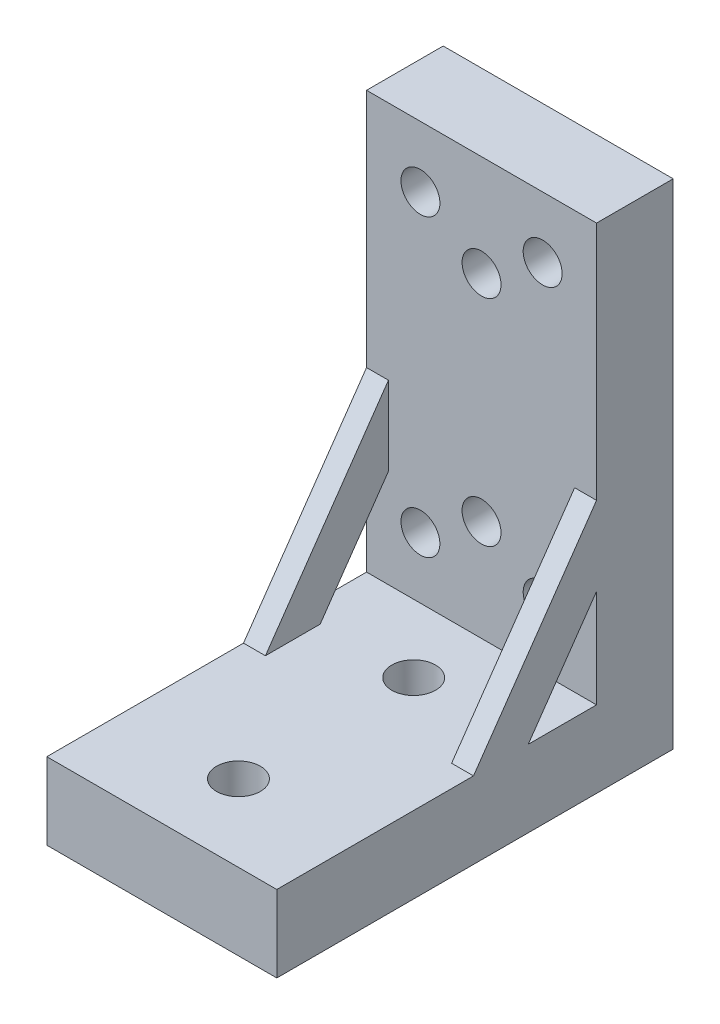
ISO-10303-21;
HEADER;
FILE_DESCRIPTION(('STEP AP214'),'2;1');
FILE_NAME('part.step','',(''),(''),'','','');
FILE_SCHEMA(('AUTOMOTIVE_DESIGN { 1 0 10303 214 1 1 1 1 }'));
ENDSEC;
DATA;
#1=APPLICATION_CONTEXT('core data for automotive mechanical design processes');
#2=APPLICATION_PROTOCOL_DEFINITION('international standard','automotive_design',2000,#1);
#3=PRODUCT_CONTEXT('',#1,'mechanical');
#4=PRODUCT('Part','Part','',(#3));
#5=PRODUCT_RELATED_PRODUCT_CATEGORY('part','',(#4));
#6=PRODUCT_DEFINITION_FORMATION('','',#4);
#7=PRODUCT_DEFINITION_CONTEXT('part definition',#1,'design');
#8=PRODUCT_DEFINITION('design','',#6,#7);
#9=PRODUCT_DEFINITION_SHAPE('','',#8);
#10=(LENGTH_UNIT() NAMED_UNIT(*) SI_UNIT(.MILLI.,.METRE.));
#11=(NAMED_UNIT(*) PLANE_ANGLE_UNIT() SI_UNIT($,.RADIAN.));
#12=(NAMED_UNIT(*) SI_UNIT($,.STERADIAN.) SOLID_ANGLE_UNIT());
#13=UNCERTAINTY_MEASURE_WITH_UNIT(LENGTH_MEASURE(1.E-05),#10,'distance_accuracy_value','');
#14=(GEOMETRIC_REPRESENTATION_CONTEXT(3) GLOBAL_UNCERTAINTY_ASSIGNED_CONTEXT((#13)) GLOBAL_UNIT_ASSIGNED_CONTEXT((#10,
#11,#12)) REPRESENTATION_CONTEXT('',''));
#15=CARTESIAN_POINT('',(0.,0.,0.));
#16=DIRECTION('',(0.,0.,1.));
#17=DIRECTION('',(1.,0.,0.));
#18=AXIS2_PLACEMENT_3D('',#15,#16,#17);
#19=CARTESIAN_POINT('',(0.,0.,7.));
#20=DIRECTION('',(0.,0.,1.));
#21=DIRECTION('',(1.,0.,0.));
#22=AXIS2_PLACEMENT_3D('',#19,#20,#21);
#23=PLANE('',#22);
#24=DIRECTION('',(-1.,0.,0.));
#25=VECTOR('',#24,1.);
#26=CARTESIAN_POINT('',(0.,-2.87885066998273,7.));
#27=LINE('',#26,#25);
#28=CARTESIAN_POINT('',(-8.49999999999999,-2.87885066998273,7.));
#29=VERTEX_POINT('',#28);
#30=CARTESIAN_POINT('',(-10.5,-2.87885066998273,7.));
#31=VERTEX_POINT('',#30);
#32=EDGE_CURVE('E179',#29,#31,#27,.T.);
#33=ORIENTED_EDGE('',*,*,#32,.F.);
#34=DIRECTION('',(0.,1.,0.));
#35=VECTOR('',#34,1.);
#36=CARTESIAN_POINT('',(-8.49999999999999,0.,7.));
#37=LINE('',#36,#35);
#38=CARTESIAN_POINT('',(-8.49999999999999,-10.0759773449372,7.));
#39=VERTEX_POINT('',#38);
#40=EDGE_CURVE('E55',#39,#29,#37,.T.);
#41=ORIENTED_EDGE('',*,*,#40,.F.);
#42=DIRECTION('',(1.,0.,0.));
#43=VECTOR('',#42,1.);
#44=CARTESIAN_POINT('',(0.,-10.0759773449371,7.));
#45=LINE('',#44,#43);
#46=CARTESIAN_POINT('',(-10.5,-10.0759773449371,7.));
#47=VERTEX_POINT('',#46);
#48=EDGE_CURVE('E59',#47,#39,#45,.T.);
#49=ORIENTED_EDGE('',*,*,#48,.F.);
#50=DIRECTION('',(0.,-1.,0.));
#51=VECTOR('',#50,1.);
#52=CARTESIAN_POINT('',(-10.5,19.05,7.));
#53=LINE('',#52,#51);
#54=CARTESIAN_POINT('',(-10.5,-19.05,7.));
#55=VERTEX_POINT('',#54);
#56=EDGE_CURVE('E325',#47,#55,#53,.T.);
#57=ORIENTED_EDGE('',*,*,#56,.T.);
#58=DIRECTION('',(1.,0.,0.));
#59=VECTOR('',#58,1.);
#60=CARTESIAN_POINT('',(-10.5,-19.05,7.));
#61=LINE('',#60,#59);
#62=CARTESIAN_POINT('',(10.5,-19.05,7.));
#63=VERTEX_POINT('',#62);
#64=EDGE_CURVE('E324',#55,#63,#61,.T.);
#65=ORIENTED_EDGE('',*,*,#64,.T.);
#66=DIRECTION('',(0.,1.,0.));
#67=VECTOR('',#66,1.);
#68=CARTESIAN_POINT('',(10.5,19.05,7.));
#69=LINE('',#68,#67);
#70=CARTESIAN_POINT('',(10.5,-10.0759773449372,7.));
#71=VERTEX_POINT('',#70);
#72=EDGE_CURVE('E330',#63,#71,#69,.T.);
#73=ORIENTED_EDGE('',*,*,#72,.T.);
#74=DIRECTION('',(1.,0.,0.));
#75=VECTOR('',#74,1.);
#76=CARTESIAN_POINT('',(0.,-10.0759773449371,7.));
#77=LINE('',#76,#75);
#78=CARTESIAN_POINT('',(8.5,-10.0759773449372,7.));
#79=VERTEX_POINT('',#78);
#80=EDGE_CURVE('E209',#79,#71,#77,.T.);
#81=ORIENTED_EDGE('',*,*,#80,.F.);
#82=DIRECTION('',(0.,1.,0.));
#83=VECTOR('',#82,1.);
#84=CARTESIAN_POINT('',(8.5,0.,7.));
#85=LINE('',#84,#83);
#86=CARTESIAN_POINT('',(8.5,-2.87885066998273,7.));
#87=VERTEX_POINT('',#86);
#88=EDGE_CURVE('E202',#79,#87,#85,.T.);
#89=ORIENTED_EDGE('',*,*,#88,.T.);
#90=DIRECTION('',(-1.,0.,0.));
#91=VECTOR('',#90,1.);
#92=CARTESIAN_POINT('',(0.,-2.87885066998273,7.));
#93=LINE('',#92,#91);
#94=CARTESIAN_POINT('',(10.5,-2.87885066998273,7.));
#95=VERTEX_POINT('',#94);
#96=EDGE_CURVE('E217',#95,#87,#93,.T.);
#97=ORIENTED_EDGE('',*,*,#96,.F.);
#98=CARTESIAN_POINT('',(10.5,19.05,7.));
#99=VERTEX_POINT('',#98);
#100=EDGE_CURVE('E329',#95,#99,#69,.T.);
#101=ORIENTED_EDGE('',*,*,#100,.T.);
#102=DIRECTION('',(-1.,0.,0.));
#103=VECTOR('',#102,1.);
#104=CARTESIAN_POINT('',(-10.5,19.05,7.));
#105=LINE('',#104,#103);
#106=CARTESIAN_POINT('',(-10.5,19.05,7.));
#107=VERTEX_POINT('',#106);
#108=EDGE_CURVE('E333',#99,#107,#105,.T.);
#109=ORIENTED_EDGE('',*,*,#108,.T.);
#110=EDGE_CURVE('E321',#107,#31,#53,.T.);
#111=ORIENTED_EDGE('',*,*,#110,.T.);
#112=EDGE_LOOP('',(#33,#41,#49,#57,#65,#73,#81,#89,#97,#101,#109,#111));
#113=FACE_BOUND('',#112,.T.);
#114=CARTESIAN_POINT('',(0.,-9.805,7.));
#115=DIRECTION('',(0.,0.,1.));
#116=DIRECTION('',(-1.,0.,0.));
#117=AXIS2_PLACEMENT_3D('',#114,#115,#116);
#118=CIRCLE('',#117,1.778);
#119=CARTESIAN_POINT('',(-1.778,-9.805,7.));
#120=VERTEX_POINT('',#119);
#121=EDGE_CURVE('E281',#120,#120,#118,.T.);
#122=ORIENTED_EDGE('',*,*,#121,.F.);
#123=EDGE_LOOP('',(#122));
#124=FACE_BOUND('',#123,.T.);
#125=CARTESIAN_POINT('',(0.,9.805,7.));
#126=DIRECTION('',(0.,0.,1.));
#127=DIRECTION('',(1.,0.,0.));
#128=AXIS2_PLACEMENT_3D('',#125,#126,#127);
#129=CIRCLE('',#128,1.778);
#130=CARTESIAN_POINT('',(1.778,9.805,7.));
#131=VERTEX_POINT('',#130);
#132=EDGE_CURVE('E297',#131,#131,#129,.T.);
#133=ORIENTED_EDGE('',*,*,#132,.F.);
#134=EDGE_LOOP('',(#133));
#135=FACE_BOUND('',#134,.T.);
#136=CARTESIAN_POINT('',(-5.58,13.47,7.));
#137=DIRECTION('',(0.,0.,1.));
#138=DIRECTION('',(1.,0.,0.));
#139=AXIS2_PLACEMENT_3D('',#136,#137,#138);
#140=CIRCLE('',#139,1.778);
#141=CARTESIAN_POINT('',(-3.802,13.47,7.));
#142=VERTEX_POINT('',#141);
#143=EDGE_CURVE('E313',#142,#142,#140,.T.);
#144=ORIENTED_EDGE('',*,*,#143,.F.);
#145=EDGE_LOOP('',(#144));
#146=FACE_BOUND('',#145,.T.);
#147=CARTESIAN_POINT('',(5.58,13.47,7.));
#148=DIRECTION('',(0.,0.,1.));
#149=DIRECTION('',(1.,0.,0.));
#150=AXIS2_PLACEMENT_3D('',#147,#148,#149);
#151=CIRCLE('',#150,1.778);
#152=CARTESIAN_POINT('',(7.35799999999999,13.47,7.));
#153=VERTEX_POINT('',#152);
#154=EDGE_CURVE('E305',#153,#153,#151,.T.);
#155=ORIENTED_EDGE('',*,*,#154,.F.);
#156=EDGE_LOOP('',(#155));
#157=FACE_BOUND('',#156,.T.);
#158=CARTESIAN_POINT('',(5.58,-13.47,7.));
#159=DIRECTION('',(0.,0.,1.));
#160=DIRECTION('',(-1.,0.,0.));
#161=AXIS2_PLACEMENT_3D('',#158,#159,#160);
#162=CIRCLE('',#161,1.778);
#163=CARTESIAN_POINT('',(3.802,-13.47,7.));
#164=VERTEX_POINT('',#163);
#165=EDGE_CURVE('E289',#164,#164,#162,.T.);
#166=ORIENTED_EDGE('',*,*,#165,.F.);
#167=EDGE_LOOP('',(#166));
#168=FACE_BOUND('',#167,.T.);
#169=CARTESIAN_POINT('',(-5.58,-13.47,7.));
#170=DIRECTION('',(0.,0.,1.));
#171=DIRECTION('',(-1.,0.,0.));
#172=AXIS2_PLACEMENT_3D('',#169,#170,#171);
#173=CIRCLE('',#172,1.778);
#174=CARTESIAN_POINT('',(-7.358,-13.47,7.));
#175=VERTEX_POINT('',#174);
#176=EDGE_CURVE('E273',#175,#175,#173,.T.);
#177=ORIENTED_EDGE('',*,*,#176,.F.);
#178=EDGE_LOOP('',(#177));
#179=FACE_BOUND('',#178,.T.);
#180=ADVANCED_FACE('F39',(#113,#124,#135,#146,#157,#168,#179),#23,.T.);
#181=CARTESIAN_POINT('',(0.,0.,0.));
#182=DIRECTION('',(0.,0.,1.));
#183=DIRECTION('',(1.,0.,0.));
#184=AXIS2_PLACEMENT_3D('',#181,#182,#183);
#185=PLANE('',#184);
#186=DIRECTION('',(-1.,0.,0.));
#187=VECTOR('',#186,1.);
#188=CARTESIAN_POINT('',(-10.5,-26.05,0.));
#189=LINE('',#188,#187);
#190=CARTESIAN_POINT('',(10.5,-26.05,0.));
#191=VERTEX_POINT('',#190);
#192=CARTESIAN_POINT('',(-10.5,-26.05,0.));
#193=VERTEX_POINT('',#192);
#194=EDGE_CURVE('E237',#191,#193,#189,.T.);
#195=ORIENTED_EDGE('',*,*,#194,.T.);
#196=DIRECTION('',(0.,-1.,0.));
#197=VECTOR('',#196,1.);
#198=CARTESIAN_POINT('',(-10.5,19.05,0.));
#199=LINE('',#198,#197);
#200=CARTESIAN_POINT('',(-10.5,19.05,0.));
#201=VERTEX_POINT('',#200);
#202=EDGE_CURVE('E317',#201,#193,#199,.T.);
#203=ORIENTED_EDGE('',*,*,#202,.F.);
#204=DIRECTION('',(-1.,0.,0.));
#205=VECTOR('',#204,1.);
#206=CARTESIAN_POINT('',(-10.5,19.05,0.));
#207=LINE('',#206,#205);
#208=CARTESIAN_POINT('',(10.5,19.05,0.));
#209=VERTEX_POINT('',#208);
#210=EDGE_CURVE('E341',#209,#201,#207,.T.);
#211=ORIENTED_EDGE('',*,*,#210,.F.);
#212=DIRECTION('',(0.,1.,0.));
#213=VECTOR('',#212,1.);
#214=CARTESIAN_POINT('',(10.5,19.05,0.));
#215=LINE('',#214,#213);
#216=EDGE_CURVE('E338',#191,#209,#215,.T.);
#217=ORIENTED_EDGE('',*,*,#216,.F.);
#218=EDGE_LOOP('',(#195,#203,#211,#217));
#219=FACE_BOUND('',#218,.T.);
#220=CARTESIAN_POINT('',(-5.58,13.47,0.));
#221=DIRECTION('',(0.,0.,1.));
#222=DIRECTION('',(1.,0.,0.));
#223=AXIS2_PLACEMENT_3D('',#220,#221,#222);
#224=CIRCLE('',#223,1.778);
#225=CARTESIAN_POINT('',(-3.802,13.47,0.));
#226=VERTEX_POINT('',#225);
#227=EDGE_CURVE('E309',#226,#226,#224,.T.);
#228=ORIENTED_EDGE('',*,*,#227,.T.);
#229=EDGE_LOOP('',(#228));
#230=FACE_BOUND('',#229,.T.);
#231=CARTESIAN_POINT('',(5.58,13.47,0.));
#232=DIRECTION('',(0.,0.,1.));
#233=DIRECTION('',(1.,0.,0.));
#234=AXIS2_PLACEMENT_3D('',#231,#232,#233);
#235=CIRCLE('',#234,1.778);
#236=CARTESIAN_POINT('',(7.35799999999999,13.47,0.));
#237=VERTEX_POINT('',#236);
#238=EDGE_CURVE('E301',#237,#237,#235,.T.);
#239=ORIENTED_EDGE('',*,*,#238,.T.);
#240=EDGE_LOOP('',(#239));
#241=FACE_BOUND('',#240,.T.);
#242=CARTESIAN_POINT('',(0.,9.805,0.));
#243=DIRECTION('',(0.,0.,1.));
#244=DIRECTION('',(1.,0.,0.));
#245=AXIS2_PLACEMENT_3D('',#242,#243,#244);
#246=CIRCLE('',#245,1.778);
#247=CARTESIAN_POINT('',(1.778,9.805,0.));
#248=VERTEX_POINT('',#247);
#249=EDGE_CURVE('E293',#248,#248,#246,.T.);
#250=ORIENTED_EDGE('',*,*,#249,.T.);
#251=EDGE_LOOP('',(#250));
#252=FACE_BOUND('',#251,.T.);
#253=CARTESIAN_POINT('',(5.58,-13.47,0.));
#254=DIRECTION('',(0.,0.,1.));
#255=DIRECTION('',(-1.,0.,0.));
#256=AXIS2_PLACEMENT_3D('',#253,#254,#255);
#257=CIRCLE('',#256,1.778);
#258=CARTESIAN_POINT('',(3.802,-13.47,0.));
#259=VERTEX_POINT('',#258);
#260=EDGE_CURVE('E285',#259,#259,#257,.T.);
#261=ORIENTED_EDGE('',*,*,#260,.T.);
#262=EDGE_LOOP('',(#261));
#263=FACE_BOUND('',#262,.T.);
#264=CARTESIAN_POINT('',(0.,-9.805,0.));
#265=DIRECTION('',(0.,0.,1.));
#266=DIRECTION('',(-1.,0.,0.));
#267=AXIS2_PLACEMENT_3D('',#264,#265,#266);
#268=CIRCLE('',#267,1.778);
#269=CARTESIAN_POINT('',(-1.778,-9.805,0.));
#270=VERTEX_POINT('',#269);
#271=EDGE_CURVE('E277',#270,#270,#268,.T.);
#272=ORIENTED_EDGE('',*,*,#271,.T.);
#273=EDGE_LOOP('',(#272));
#274=FACE_BOUND('',#273,.T.);
#275=CARTESIAN_POINT('',(-5.58,-13.47,0.));
#276=DIRECTION('',(0.,0.,1.));
#277=DIRECTION('',(-1.,0.,0.));
#278=AXIS2_PLACEMENT_3D('',#275,#276,#277);
#279=CIRCLE('',#278,1.778);
#280=CARTESIAN_POINT('',(-7.358,-13.47,0.));
#281=VERTEX_POINT('',#280);
#282=EDGE_CURVE('E261',#281,#281,#279,.T.);
#283=ORIENTED_EDGE('',*,*,#282,.T.);
#284=EDGE_LOOP('',(#283));
#285=FACE_BOUND('',#284,.T.);
#286=ADVANCED_FACE('F355',(#219,#230,#241,#252,#263,#274,#285),#185,.F.);
#287=CARTESIAN_POINT('',(-10.5,19.05,7.));
#288=DIRECTION('',(1.,0.,0.));
#289=DIRECTION('',(0.,1.,0.));
#290=AXIS2_PLACEMENT_3D('',#287,#288,#289);
#291=PLANE('',#290);
#292=DIRECTION('',(0.,-0.8212632767965,0.570549410818622));
#293=VECTOR('',#292,1.);
#294=CARTESIAN_POINT('',(-10.5,-26.05,23.0975));
#295=LINE('',#294,#293);
#296=CARTESIAN_POINT('',(-10.5,-19.05,18.2344481765833));
#297=VERTEX_POINT('',#296);
#298=EDGE_CURVE('E161',#31,#297,#295,.T.);
#299=ORIENTED_EDGE('',*,*,#298,.F.);
#300=ORIENTED_EDGE('',*,*,#110,.F.);
#301=DIRECTION('',(0.,0.,-1.));
#302=VECTOR('',#301,1.);
#303=CARTESIAN_POINT('',(-10.5,19.05,7.));
#304=LINE('',#303,#302);
#305=EDGE_CURVE('E48',#107,#201,#304,.T.);
#306=ORIENTED_EDGE('',*,*,#305,.T.);
#307=ORIENTED_EDGE('',*,*,#202,.T.);
#308=DIRECTION('',(0.,0.,-1.));
#309=VECTOR('',#308,1.);
#310=CARTESIAN_POINT('',(-10.5,-26.05,36.195));
#311=LINE('',#310,#309);
#312=CARTESIAN_POINT('',(-10.5,-26.05,36.195));
#313=VERTEX_POINT('',#312);
#314=EDGE_CURVE('E257',#313,#193,#311,.T.);
#315=ORIENTED_EDGE('',*,*,#314,.F.);
#316=DIRECTION('',(0.,1.,0.));
#317=VECTOR('',#316,1.);
#318=CARTESIAN_POINT('',(-10.5,-19.05,36.195));
#319=LINE('',#318,#317);
#320=CARTESIAN_POINT('',(-10.5,-19.05,36.195));
#321=VERTEX_POINT('',#320);
#322=EDGE_CURVE('E238',#313,#321,#319,.T.);
#323=ORIENTED_EDGE('',*,*,#322,.T.);
#324=DIRECTION('',(0.,0.,-1.));
#325=VECTOR('',#324,1.);
#326=CARTESIAN_POINT('',(-10.5,-19.05,36.195));
#327=LINE('',#326,#325);
#328=EDGE_CURVE('E269',#321,#297,#327,.T.);
#329=ORIENTED_EDGE('',*,*,#328,.T.);
#330=EDGE_LOOP('',(#299,#300,#306,#307,#315,#323,#329));
#331=FACE_BOUND('',#330,.T.);
#332=ORIENTED_EDGE('',*,*,#56,.F.);
#333=DIRECTION('',(0.,0.821263276796508,-0.57054941081861));
#334=VECTOR('',#333,1.);
#335=CARTESIAN_POINT('',(-10.5,-26.05,18.0975));
#336=LINE('',#335,#334);
#337=CARTESIAN_POINT('',(-10.5,-19.05,13.2344481765835));
#338=VERTEX_POINT('',#337);
#339=EDGE_CURVE('E167',#338,#47,#336,.T.);
#340=ORIENTED_EDGE('',*,*,#339,.F.);
#341=EDGE_CURVE('E146',#338,#55,#327,.T.);
#342=ORIENTED_EDGE('',*,*,#341,.T.);
#343=EDGE_LOOP('',(#332,#340,#342));
#344=FACE_BOUND('',#343,.T.);
#345=ADVANCED_FACE('F41',(#331,#344),#291,.F.);
#346=CARTESIAN_POINT('',(10.5,19.05,7.));
#347=DIRECTION('',(-1.,0.,0.));
#348=DIRECTION('',(0.,0.,1.));
#349=AXIS2_PLACEMENT_3D('',#346,#347,#348);
#350=PLANE('',#349);
#351=ORIENTED_EDGE('',*,*,#100,.F.);
#352=DIRECTION('',(0.,-0.8212632767965,0.570549410818622));
#353=VECTOR('',#352,1.);
#354=CARTESIAN_POINT('',(10.5,-26.05,23.0975));
#355=LINE('',#354,#353);
#356=CARTESIAN_POINT('',(10.5,-19.05,18.2344481765833));
#357=VERTEX_POINT('',#356);
#358=EDGE_CURVE('E189',#95,#357,#355,.T.);
#359=ORIENTED_EDGE('',*,*,#358,.T.);
#360=DIRECTION('',(0.,0.,-1.));
#361=VECTOR('',#360,1.);
#362=CARTESIAN_POINT('',(10.5,-19.05,36.195));
#363=LINE('',#362,#361);
#364=CARTESIAN_POINT('',(10.5,-19.05,36.195));
#365=VERTEX_POINT('',#364);
#366=EDGE_CURVE('E265',#365,#357,#363,.T.);
#367=ORIENTED_EDGE('',*,*,#366,.F.);
#368=DIRECTION('',(0.,-1.,0.));
#369=VECTOR('',#368,1.);
#370=CARTESIAN_POINT('',(10.5,-19.05,36.195));
#371=LINE('',#370,#369);
#372=CARTESIAN_POINT('',(10.5,-26.05,36.195));
#373=VERTEX_POINT('',#372);
#374=EDGE_CURVE('E246',#365,#373,#371,.T.);
#375=ORIENTED_EDGE('',*,*,#374,.T.);
#376=DIRECTION('',(0.,0.,-1.));
#377=VECTOR('',#376,1.);
#378=CARTESIAN_POINT('',(10.5,-26.05,36.195));
#379=LINE('',#378,#377);
#380=EDGE_CURVE('E262',#373,#191,#379,.T.);
#381=ORIENTED_EDGE('',*,*,#380,.T.);
#382=ORIENTED_EDGE('',*,*,#216,.T.);
#383=DIRECTION('',(0.,0.,-1.));
#384=VECTOR('',#383,1.);
#385=CARTESIAN_POINT('',(10.5,19.05,7.));
#386=LINE('',#385,#384);
#387=EDGE_CURVE('E11',#99,#209,#386,.T.);
#388=ORIENTED_EDGE('',*,*,#387,.F.);
#389=EDGE_LOOP('',(#351,#359,#367,#375,#381,#382,#388));
#390=FACE_BOUND('',#389,.T.);
#391=DIRECTION('',(0.,0.821263276796508,-0.57054941081861));
#392=VECTOR('',#391,1.);
#393=CARTESIAN_POINT('',(10.5,-26.05,18.0975));
#394=LINE('',#393,#392);
#395=CARTESIAN_POINT('',(10.5,-19.05,13.2344481765835));
#396=VERTEX_POINT('',#395);
#397=EDGE_CURVE('E183',#396,#71,#394,.T.);
#398=ORIENTED_EDGE('',*,*,#397,.T.);
#399=ORIENTED_EDGE('',*,*,#72,.F.);
#400=EDGE_CURVE('E268',#396,#63,#363,.T.);
#401=ORIENTED_EDGE('',*,*,#400,.F.);
#402=EDGE_LOOP('',(#398,#399,#401));
#403=FACE_BOUND('',#402,.T.);
#404=ADVANCED_FACE('F381',(#390,#403),#350,.F.);
#405=CARTESIAN_POINT('',(-10.5,19.05,7.));
#406=DIRECTION('',(0.,-1.,0.));
#407=DIRECTION('',(0.,0.,-1.));
#408=AXIS2_PLACEMENT_3D('',#405,#406,#407);
#409=PLANE('',#408);
#410=ORIENTED_EDGE('',*,*,#210,.T.);
#411=ORIENTED_EDGE('',*,*,#305,.F.);
#412=ORIENTED_EDGE('',*,*,#108,.F.);
#413=ORIENTED_EDGE('',*,*,#387,.T.);
#414=EDGE_LOOP('',(#410,#411,#412,#413));
#415=FACE_BOUND('',#414,.T.);
#416=ADVANCED_FACE('F397',(#415),#409,.F.);
#417=CARTESIAN_POINT('',(-5.58,13.47,7.));
#418=DIRECTION('',(0.,0.,-1.));
#419=DIRECTION('',(-1.,0.,0.));
#420=AXIS2_PLACEMENT_3D('',#417,#418,#419);
#421=CYLINDRICAL_SURFACE('',#420,1.778);
#422=ORIENTED_EDGE('',*,*,#143,.T.);
#423=EDGE_LOOP('',(#422));
#424=FACE_BOUND('',#423,.T.);
#425=ORIENTED_EDGE('',*,*,#227,.F.);
#426=EDGE_LOOP('',(#425));
#427=FACE_BOUND('',#426,.T.);
#428=ADVANCED_FACE('F399',(#424,#427),#421,.F.);
#429=CARTESIAN_POINT('',(5.58,13.47,7.));
#430=DIRECTION('',(0.,0.,-1.));
#431=DIRECTION('',(-1.,0.,0.));
#432=AXIS2_PLACEMENT_3D('',#429,#430,#431);
#433=CYLINDRICAL_SURFACE('',#432,1.778);
#434=ORIENTED_EDGE('',*,*,#154,.T.);
#435=EDGE_LOOP('',(#434));
#436=FACE_BOUND('',#435,.T.);
#437=ORIENTED_EDGE('',*,*,#238,.F.);
#438=EDGE_LOOP('',(#437));
#439=FACE_BOUND('',#438,.T.);
#440=ADVANCED_FACE('F405',(#436,#439),#433,.F.);
#441=CARTESIAN_POINT('',(0.,9.805,7.));
#442=DIRECTION('',(0.,0.,-1.));
#443=DIRECTION('',(-1.,0.,0.));
#444=AXIS2_PLACEMENT_3D('',#441,#442,#443);
#445=CYLINDRICAL_SURFACE('',#444,1.778);
#446=ORIENTED_EDGE('',*,*,#132,.T.);
#447=EDGE_LOOP('',(#446));
#448=FACE_BOUND('',#447,.T.);
#449=ORIENTED_EDGE('',*,*,#249,.F.);
#450=EDGE_LOOP('',(#449));
#451=FACE_BOUND('',#450,.T.);
#452=ADVANCED_FACE('F419',(#448,#451),#445,.F.);
#453=CARTESIAN_POINT('',(5.58,-13.47,7.));
#454=DIRECTION('',(0.,0.,-1.));
#455=DIRECTION('',(-1.,0.,0.));
#456=AXIS2_PLACEMENT_3D('',#453,#454,#455);
#457=CYLINDRICAL_SURFACE('',#456,1.778);
#458=ORIENTED_EDGE('',*,*,#165,.T.);
#459=EDGE_LOOP('',(#458));
#460=FACE_BOUND('',#459,.T.);
#461=ORIENTED_EDGE('',*,*,#260,.F.);
#462=EDGE_LOOP('',(#461));
#463=FACE_BOUND('',#462,.T.);
#464=ADVANCED_FACE('F423',(#460,#463),#457,.F.);
#465=CARTESIAN_POINT('',(0.,-9.805,7.));
#466=DIRECTION('',(0.,0.,-1.));
#467=DIRECTION('',(-1.,0.,0.));
#468=AXIS2_PLACEMENT_3D('',#465,#466,#467);
#469=CYLINDRICAL_SURFACE('',#468,1.778);
#470=ORIENTED_EDGE('',*,*,#121,.T.);
#471=EDGE_LOOP('',(#470));
#472=FACE_BOUND('',#471,.T.);
#473=ORIENTED_EDGE('',*,*,#271,.F.);
#474=EDGE_LOOP('',(#473));
#475=FACE_BOUND('',#474,.T.);
#476=ADVANCED_FACE('F427',(#472,#475),#469,.F.);
#477=CARTESIAN_POINT('',(-5.58,-13.47,7.));
#478=DIRECTION('',(0.,0.,-1.));
#479=DIRECTION('',(-1.,0.,0.));
#480=AXIS2_PLACEMENT_3D('',#477,#478,#479);
#481=CYLINDRICAL_SURFACE('',#480,1.778);
#482=ORIENTED_EDGE('',*,*,#176,.T.);
#483=EDGE_LOOP('',(#482));
#484=FACE_BOUND('',#483,.T.);
#485=ORIENTED_EDGE('',*,*,#282,.F.);
#486=EDGE_LOOP('',(#485));
#487=FACE_BOUND('',#486,.T.);
#488=ADVANCED_FACE('F431',(#484,#487),#481,.F.);
#489=CARTESIAN_POINT('',(-10.5,-19.05,36.195));
#490=DIRECTION('',(0.,1.,0.));
#491=DIRECTION('',(-1.,0.,0.));
#492=AXIS2_PLACEMENT_3D('',#489,#490,#491);
#493=PLANE('',#492);
#494=DIRECTION('',(1.,0.,0.));
#495=VECTOR('',#494,1.);
#496=CARTESIAN_POINT('',(-10.5,-19.05,18.2344481765833));
#497=LINE('',#496,#495);
#498=CARTESIAN_POINT('',(-8.49999999999999,-19.05,18.2344481765833));
#499=VERTEX_POINT('',#498);
#500=EDGE_CURVE('E176',#297,#499,#497,.T.);
#501=ORIENTED_EDGE('',*,*,#500,.F.);
#502=ORIENTED_EDGE('',*,*,#328,.F.);
#503=DIRECTION('',(1.,0.,0.));
#504=VECTOR('',#503,1.);
#505=CARTESIAN_POINT('',(-10.5,-19.05,36.195));
#506=LINE('',#505,#504);
#507=EDGE_CURVE('E242',#321,#365,#506,.T.);
#508=ORIENTED_EDGE('',*,*,#507,.T.);
#509=ORIENTED_EDGE('',*,*,#366,.T.);
#510=DIRECTION('',(1.,0.,0.));
#511=VECTOR('',#510,1.);
#512=CARTESIAN_POINT('',(-10.5,-19.05,18.2344481765833));
#513=LINE('',#512,#511);
#514=CARTESIAN_POINT('',(8.5,-19.05,18.2344481765833));
#515=VERTEX_POINT('',#514);
#516=EDGE_CURVE('E213',#515,#357,#513,.T.);
#517=ORIENTED_EDGE('',*,*,#516,.F.);
#518=DIRECTION('',(0.,0.,-1.));
#519=VECTOR('',#518,1.);
#520=CARTESIAN_POINT('',(8.50000000000001,-19.05,36.195));
#521=LINE('',#520,#519);
#522=CARTESIAN_POINT('',(8.5,-19.05,13.2344481765835));
#523=VERTEX_POINT('',#522);
#524=EDGE_CURVE('E193',#515,#523,#521,.T.);
#525=ORIENTED_EDGE('',*,*,#524,.T.);
#526=DIRECTION('',(-1.,0.,0.));
#527=VECTOR('',#526,1.);
#528=CARTESIAN_POINT('',(-10.5,-19.05,13.2344481765835));
#529=LINE('',#528,#527);
#530=EDGE_CURVE('E205',#396,#523,#529,.T.);
#531=ORIENTED_EDGE('',*,*,#530,.F.);
#532=ORIENTED_EDGE('',*,*,#400,.T.);
#533=ORIENTED_EDGE('',*,*,#64,.F.);
#534=ORIENTED_EDGE('',*,*,#341,.F.);
#535=DIRECTION('',(-1.,0.,0.));
#536=VECTOR('',#535,1.);
#537=CARTESIAN_POINT('',(-10.5,-19.05,13.2344481765835));
#538=LINE('',#537,#536);
#539=CARTESIAN_POINT('',(-8.49999999999999,-19.05,13.2344481765835));
#540=VERTEX_POINT('',#539);
#541=EDGE_CURVE('E138',#540,#338,#538,.T.);
#542=ORIENTED_EDGE('',*,*,#541,.F.);
#543=DIRECTION('',(0.,0.,-1.));
#544=VECTOR('',#543,1.);
#545=CARTESIAN_POINT('',(-8.49999999999999,-19.05,36.195));
#546=LINE('',#545,#544);
#547=EDGE_CURVE('E142',#499,#540,#546,.T.);
#548=ORIENTED_EDGE('',*,*,#547,.F.);
#549=EDGE_LOOP('',(#501,#502,#508,#509,#517,#525,#531,#532,#533,#534,#542,#548));
#550=FACE_BOUND('',#549,.T.);
#551=CARTESIAN_POINT('',(0.,-19.05,13.195));
#552=DIRECTION('',(0.,1.,0.));
#553=DIRECTION('',(-1.,0.,0.));
#554=AXIS2_PLACEMENT_3D('',#551,#552,#553);
#555=CIRCLE('',#554,2.);
#556=CARTESIAN_POINT('',(-2.,-19.05,13.195));
#557=VERTEX_POINT('',#556);
#558=EDGE_CURVE('E233',#557,#557,#555,.T.);
#559=ORIENTED_EDGE('',*,*,#558,.F.);
#560=EDGE_LOOP('',(#559));
#561=FACE_BOUND('',#560,.T.);
#562=CARTESIAN_POINT('',(0.,-19.05,29.195));
#563=DIRECTION('',(0.,1.,0.));
#564=DIRECTION('',(-1.,0.,0.));
#565=AXIS2_PLACEMENT_3D('',#562,#563,#564);
#566=CIRCLE('',#565,2.);
#567=CARTESIAN_POINT('',(-2.,-19.05,29.195));
#568=VERTEX_POINT('',#567);
#569=EDGE_CURVE('E226',#568,#568,#566,.T.);
#570=ORIENTED_EDGE('',*,*,#569,.F.);
#571=EDGE_LOOP('',(#570));
#572=FACE_BOUND('',#571,.T.);
#573=ADVANCED_FACE('F140',(#550,#561,#572),#493,.T.);
#574=CARTESIAN_POINT('',(-10.5,-26.05,36.195));
#575=DIRECTION('',(0.,-1.,0.));
#576=DIRECTION('',(1.,0.,0.));
#577=AXIS2_PLACEMENT_3D('',#574,#575,#576);
#578=PLANE('',#577);
#579=ORIENTED_EDGE('',*,*,#314,.T.);
#580=ORIENTED_EDGE('',*,*,#194,.F.);
#581=ORIENTED_EDGE('',*,*,#380,.F.);
#582=DIRECTION('',(-1.,0.,0.));
#583=VECTOR('',#582,1.);
#584=CARTESIAN_POINT('',(-10.5,-26.05,36.195));
#585=LINE('',#584,#583);
#586=EDGE_CURVE('E250',#373,#313,#585,.T.);
#587=ORIENTED_EDGE('',*,*,#586,.T.);
#588=EDGE_LOOP('',(#579,#580,#581,#587));
#589=FACE_BOUND('',#588,.T.);
#590=CARTESIAN_POINT('',(0.,-26.05,13.195));
#591=DIRECTION('',(0.,-1.,0.));
#592=DIRECTION('',(1.,0.,0.));
#593=AXIS2_PLACEMENT_3D('',#590,#591,#592);
#594=CIRCLE('',#593,2.);
#595=CARTESIAN_POINT('',(2.,-26.05,13.195));
#596=VERTEX_POINT('',#595);
#597=EDGE_CURVE('E222',#596,#596,#594,.T.);
#598=ORIENTED_EDGE('',*,*,#597,.F.);
#599=EDGE_LOOP('',(#598));
#600=FACE_BOUND('',#599,.T.);
#601=CARTESIAN_POINT('',(0.,-26.05,29.195));
#602=DIRECTION('',(0.,-1.,0.));
#603=DIRECTION('',(1.,0.,0.));
#604=AXIS2_PLACEMENT_3D('',#601,#602,#603);
#605=CIRCLE('',#604,2.);
#606=CARTESIAN_POINT('',(2.,-26.05,29.195));
#607=VERTEX_POINT('',#606);
#608=EDGE_CURVE('E221',#607,#607,#605,.T.);
#609=ORIENTED_EDGE('',*,*,#608,.F.);
#610=EDGE_LOOP('',(#609));
#611=FACE_BOUND('',#610,.T.);
#612=ADVANCED_FACE('F360',(#589,#600,#611),#578,.T.);
#613=CARTESIAN_POINT('',(0.,0.,36.195));
#614=DIRECTION('',(0.,0.,1.));
#615=DIRECTION('',(1.,0.,0.));
#616=AXIS2_PLACEMENT_3D('',#613,#614,#615);
#617=PLANE('',#616);
#618=ORIENTED_EDGE('',*,*,#322,.F.);
#619=ORIENTED_EDGE('',*,*,#586,.F.);
#620=ORIENTED_EDGE('',*,*,#374,.F.);
#621=ORIENTED_EDGE('',*,*,#507,.F.);
#622=EDGE_LOOP('',(#618,#619,#620,#621));
#623=FACE_BOUND('',#622,.T.);
#624=ADVANCED_FACE('F366',(#623),#617,.T.);
#625=CARTESIAN_POINT('',(0.,-15.55,29.195));
#626=DIRECTION('',(0.,-1.,0.));
#627=DIRECTION('',(1.,0.,0.));
#628=AXIS2_PLACEMENT_3D('',#625,#626,#627);
#629=CYLINDRICAL_SURFACE('',#628,2.);
#630=ORIENTED_EDGE('',*,*,#569,.T.);
#631=EDGE_LOOP('',(#630));
#632=FACE_BOUND('',#631,.T.);
#633=ORIENTED_EDGE('',*,*,#608,.T.);
#634=EDGE_LOOP('',(#633));
#635=FACE_BOUND('',#634,.T.);
#636=ADVANCED_FACE('F442',(#632,#635),#629,.F.);
#637=CARTESIAN_POINT('',(0.,-15.55,13.195));
#638=DIRECTION('',(0.,-1.,0.));
#639=DIRECTION('',(1.,0.,0.));
#640=AXIS2_PLACEMENT_3D('',#637,#638,#639);
#641=CYLINDRICAL_SURFACE('',#640,2.);
#642=ORIENTED_EDGE('',*,*,#558,.T.);
#643=EDGE_LOOP('',(#642));
#644=FACE_BOUND('',#643,.T.);
#645=ORIENTED_EDGE('',*,*,#597,.T.);
#646=EDGE_LOOP('',(#645));
#647=FACE_BOUND('',#646,.T.);
#648=ADVANCED_FACE('F445',(#644,#647),#641,.F.);
#649=CARTESIAN_POINT('',(8.5,-26.05,23.0975));
#650=DIRECTION('',(0.,0.570549410818622,0.8212632767965));
#651=DIRECTION('',(0.,-0.8212632767965,0.570549410818622));
#652=AXIS2_PLACEMENT_3D('',#649,#650,#651);
#653=PLANE('',#652);
#654=ORIENTED_EDGE('',*,*,#358,.F.);
#655=ORIENTED_EDGE('',*,*,#96,.T.);
#656=DIRECTION('',(0.,-0.8212632767965,0.570549410818622));
#657=VECTOR('',#656,1.);
#658=CARTESIAN_POINT('',(8.5,-26.05,23.0975));
#659=LINE('',#658,#657);
#660=EDGE_CURVE('E188',#87,#515,#659,.T.);
#661=ORIENTED_EDGE('',*,*,#660,.T.);
#662=ORIENTED_EDGE('',*,*,#516,.T.);
#663=EDGE_LOOP('',(#654,#655,#661,#662));
#664=FACE_BOUND('',#663,.T.);
#665=ADVANCED_FACE('F393',(#664),#653,.T.);
#666=CARTESIAN_POINT('',(8.5,-26.05,18.0975));
#667=DIRECTION('',(0.,-0.57054941081861,-0.821263276796508));
#668=DIRECTION('',(0.,0.821263276796508,-0.57054941081861));
#669=AXIS2_PLACEMENT_3D('',#666,#667,#668);
#670=PLANE('',#669);
#671=DIRECTION('',(0.,0.821263276796508,-0.57054941081861));
#672=VECTOR('',#671,1.);
#673=CARTESIAN_POINT('',(8.5,-26.05,18.0975));
#674=LINE('',#673,#672);
#675=EDGE_CURVE('E184',#523,#79,#674,.T.);
#676=ORIENTED_EDGE('',*,*,#675,.T.);
#677=ORIENTED_EDGE('',*,*,#80,.T.);
#678=ORIENTED_EDGE('',*,*,#397,.F.);
#679=ORIENTED_EDGE('',*,*,#530,.T.);
#680=EDGE_LOOP('',(#676,#677,#678,#679));
#681=FACE_BOUND('',#680,.T.);
#682=ADVANCED_FACE('F383',(#681),#670,.T.);
#683=CARTESIAN_POINT('',(8.5,0.,0.));
#684=DIRECTION('',(1.,0.,0.));
#685=DIRECTION('',(0.,0.,-1.));
#686=AXIS2_PLACEMENT_3D('',#683,#684,#685);
#687=PLANE('',#686);
#688=ORIENTED_EDGE('',*,*,#88,.F.);
#689=ORIENTED_EDGE('',*,*,#675,.F.);
#690=ORIENTED_EDGE('',*,*,#524,.F.);
#691=ORIENTED_EDGE('',*,*,#660,.F.);
#692=EDGE_LOOP('',(#688,#689,#690,#691));
#693=FACE_BOUND('',#692,.T.);
#694=ADVANCED_FACE('F389',(#693),#687,.F.);
#695=CARTESIAN_POINT('',(-10.5,-26.05,23.0975));
#696=DIRECTION('',(0.,0.570549410818622,0.8212632767965));
#697=DIRECTION('',(0.,-0.8212632767965,0.570549410818622));
#698=AXIS2_PLACEMENT_3D('',#695,#696,#697);
#699=PLANE('',#698);
#700=DIRECTION('',(0.,-0.8212632767965,0.570549410818622));
#701=VECTOR('',#700,1.);
#702=CARTESIAN_POINT('',(-8.49999999999999,-26.05,23.0975));
#703=LINE('',#702,#701);
#704=EDGE_CURVE('E159',#29,#499,#703,.T.);
#705=ORIENTED_EDGE('',*,*,#704,.F.);
#706=ORIENTED_EDGE('',*,*,#32,.T.);
#707=ORIENTED_EDGE('',*,*,#298,.T.);
#708=ORIENTED_EDGE('',*,*,#500,.T.);
#709=EDGE_LOOP('',(#705,#706,#707,#708));
#710=FACE_BOUND('',#709,.T.);
#711=ADVANCED_FACE('F370',(#710),#699,.T.);
#712=CARTESIAN_POINT('',(-10.5,-26.05,18.0975));
#713=DIRECTION('',(0.,-0.57054941081861,-0.821263276796508));
#714=DIRECTION('',(0.,0.821263276796508,-0.57054941081861));
#715=AXIS2_PLACEMENT_3D('',#712,#713,#714);
#716=PLANE('',#715);
#717=ORIENTED_EDGE('',*,*,#339,.T.);
#718=ORIENTED_EDGE('',*,*,#48,.T.);
#719=DIRECTION('',(0.,0.821263276796508,-0.57054941081861));
#720=VECTOR('',#719,1.);
#721=CARTESIAN_POINT('',(-8.49999999999999,-26.05,18.0975));
#722=LINE('',#721,#720);
#723=EDGE_CURVE('E157',#540,#39,#722,.T.);
#724=ORIENTED_EDGE('',*,*,#723,.F.);
#725=ORIENTED_EDGE('',*,*,#541,.T.);
#726=EDGE_LOOP('',(#717,#718,#724,#725));
#727=FACE_BOUND('',#726,.T.);
#728=ADVANCED_FACE('F163',(#727),#716,.T.);
#729=CARTESIAN_POINT('',(-8.49999999999999,0.,0.));
#730=DIRECTION('',(1.,0.,0.));
#731=DIRECTION('',(0.,0.,-1.));
#732=AXIS2_PLACEMENT_3D('',#729,#730,#731);
#733=PLANE('',#732);
#734=ORIENTED_EDGE('',*,*,#723,.T.);
#735=ORIENTED_EDGE('',*,*,#40,.T.);
#736=ORIENTED_EDGE('',*,*,#704,.T.);
#737=ORIENTED_EDGE('',*,*,#547,.T.);
#738=EDGE_LOOP('',(#734,#735,#736,#737));
#739=FACE_BOUND('',#738,.T.);
#740=ADVANCED_FACE('F156',(#739),#733,.T.);
#741=CLOSED_SHELL('',(#180,#286,#345,#404,#416,#428,#440,#452,#464,#476,#488,#573,#612,#624,
#636,#648,#665,#682,#694,#711,#728,#740));
#742=MANIFOLD_SOLID_BREP('B2',#741);
#743=ADVANCED_BREP_SHAPE_REPRESENTATION('',(#18,#742),#14);
#744=SHAPE_DEFINITION_REPRESENTATION(#9,#743);
ENDSEC;
END-ISO-10303-21;
